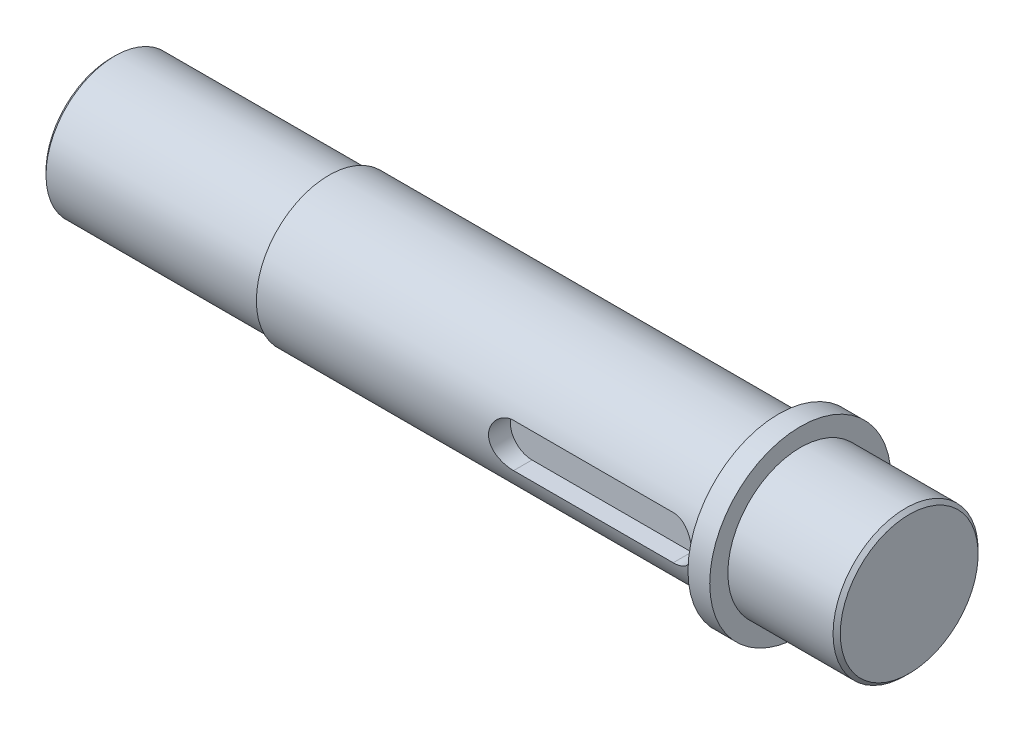
ISO-10303-21;
HEADER;
FILE_DESCRIPTION(('STEP AP214'),'2;1');
FILE_NAME('part.step','',(''),(''),'','','');
FILE_SCHEMA(('AUTOMOTIVE_DESIGN { 1 0 10303 214 1 1 1 1 }'));
ENDSEC;
DATA;
#1=APPLICATION_CONTEXT('core data for automotive mechanical design processes');
#2=APPLICATION_PROTOCOL_DEFINITION('international standard','automotive_design',2000,#1);
#3=PRODUCT_CONTEXT('',#1,'mechanical');
#4=PRODUCT('Part','Part','',(#3));
#5=PRODUCT_RELATED_PRODUCT_CATEGORY('part','',(#4));
#6=PRODUCT_DEFINITION_FORMATION('','',#4);
#7=PRODUCT_DEFINITION_CONTEXT('part definition',#1,'design');
#8=PRODUCT_DEFINITION('design','',#6,#7);
#9=PRODUCT_DEFINITION_SHAPE('','',#8);
#10=(LENGTH_UNIT() NAMED_UNIT(*) SI_UNIT(.MILLI.,.METRE.));
#11=(NAMED_UNIT(*) PLANE_ANGLE_UNIT() SI_UNIT($,.RADIAN.));
#12=(NAMED_UNIT(*) SI_UNIT($,.STERADIAN.) SOLID_ANGLE_UNIT());
#13=UNCERTAINTY_MEASURE_WITH_UNIT(LENGTH_MEASURE(1.E-05),#10,'distance_accuracy_value','');
#14=(GEOMETRIC_REPRESENTATION_CONTEXT(3) GLOBAL_UNCERTAINTY_ASSIGNED_CONTEXT((#13)) GLOBAL_UNIT_ASSIGNED_CONTEXT((#10,
#11,#12)) REPRESENTATION_CONTEXT('',''));
#15=CARTESIAN_POINT('',(0.,0.,0.));
#16=DIRECTION('',(0.,0.,1.));
#17=DIRECTION('',(1.,0.,0.));
#18=AXIS2_PLACEMENT_3D('',#15,#16,#17);
#19=CARTESIAN_POINT('',(0.,0.,0.));
#20=DIRECTION('',(1.,0.,0.));
#21=DIRECTION('',(0.,0.,-1.));
#22=AXIS2_PLACEMENT_3D('',#19,#20,#21);
#23=PLANE('',#22);
#24=CARTESIAN_POINT('',(0.,0.,0.));
#25=DIRECTION('',(1.,0.,0.));
#26=DIRECTION('',(0.,0.,-1.));
#27=AXIS2_PLACEMENT_3D('',#24,#25,#26);
#28=CIRCLE('',#27,8.99999999999999);
#29=CARTESIAN_POINT('',(0.,0.,-8.99999999999999));
#30=VERTEX_POINT('',#29);
#31=EDGE_CURVE('E208',#30,#30,#28,.F.);
#32=ORIENTED_EDGE('',*,*,#31,.T.);
#33=EDGE_LOOP('',(#32));
#34=FACE_BOUND('',#33,.T.);
#35=ADVANCED_FACE('F36',(#34),#23,.F.);
#36=CARTESIAN_POINT('',(-40.4651162790698,0.,0.));
#37=DIRECTION('',(-1.,0.,0.));
#38=DIRECTION('',(0.,0.,1.));
#39=AXIS2_PLACEMENT_3D('',#36,#37,#38);
#40=CYLINDRICAL_SURFACE('',#39,9.49999999999999);
#41=CARTESIAN_POINT('',(0.499999999999987,0.,0.));
#42=DIRECTION('',(1.,0.,0.));
#43=DIRECTION('',(0.,0.,-1.));
#44=AXIS2_PLACEMENT_3D('',#41,#42,#43);
#45=CIRCLE('',#44,9.49999999999999);
#46=CARTESIAN_POINT('',(0.499999999999987,0.,-9.49999999999999));
#47=VERTEX_POINT('',#46);
#48=EDGE_CURVE('E206',#47,#47,#45,.T.);
#49=ORIENTED_EDGE('',*,*,#48,.T.);
#50=EDGE_LOOP('',(#49));
#51=FACE_BOUND('',#50,.T.);
#52=CARTESIAN_POINT('',(30.,0.,0.));
#53=DIRECTION('',(-1.,0.,0.));
#54=DIRECTION('',(0.,0.,1.));
#55=AXIS2_PLACEMENT_3D('',#52,#53,#54);
#56=CIRCLE('',#55,9.49999999999999);
#57=CARTESIAN_POINT('',(30.,0.,9.49999999999999));
#58=VERTEX_POINT('',#57);
#59=EDGE_CURVE('E123',#58,#58,#56,.T.);
#60=ORIENTED_EDGE('',*,*,#59,.T.);
#61=EDGE_LOOP('',(#60));
#62=FACE_BOUND('',#61,.T.);
#63=ADVANCED_FACE('F183',(#51,#62),#40,.T.);
#64=CARTESIAN_POINT('',(30.,9.49999999999999,0.));
#65=DIRECTION('',(1.,0.,0.));
#66=DIRECTION('',(0.,0.,-1.));
#67=AXIS2_PLACEMENT_3D('',#64,#65,#66);
#68=PLANE('',#67);
#69=ORIENTED_EDGE('',*,*,#59,.F.);
#70=EDGE_LOOP('',(#69));
#71=FACE_BOUND('',#70,.T.);
#72=CARTESIAN_POINT('',(30.,0.,0.));
#73=DIRECTION('',(-1.,0.,0.));
#74=DIRECTION('',(0.,0.,1.));
#75=AXIS2_PLACEMENT_3D('',#72,#73,#74);
#76=CIRCLE('',#75,9.99999999999999);
#77=CARTESIAN_POINT('',(30.,0.,9.99999999999999));
#78=VERTEX_POINT('',#77);
#79=EDGE_CURVE('E120',#78,#78,#76,.T.);
#80=ORIENTED_EDGE('',*,*,#79,.T.);
#81=EDGE_LOOP('',(#80));
#82=FACE_BOUND('',#81,.T.);
#83=ADVANCED_FACE('F178',(#71,#82),#68,.F.);
#84=CARTESIAN_POINT('',(-40.4651162790698,0.,0.));
#85=DIRECTION('',(-1.,0.,0.));
#86=DIRECTION('',(0.,0.,1.));
#87=AXIS2_PLACEMENT_3D('',#84,#85,#86);
#88=CYLINDRICAL_SURFACE('',#87,9.99999999999999);
#89=DIRECTION('',(-1.,0.,0.));
#90=VECTOR('',#89,1.);
#91=CARTESIAN_POINT('',(-40.4651162790698,3.,9.53939201416944));
#92=LINE('',#91,#90);
#93=CARTESIAN_POINT('',(65.,3.,9.53939201416944));
#94=VERTEX_POINT('',#93);
#95=CARTESIAN_POINT('',(87.,3.,9.53939201416944));
#96=VERTEX_POINT('',#95);
#97=EDGE_CURVE('E60',#94,#96,#92,.F.);
#98=ORIENTED_EDGE('',*,*,#97,.T.);
#99=CARTESIAN_POINT('',(87.,3.,9.53939201416944));
#100=CARTESIAN_POINT('',(87.0823355208227,3.00001027845728,9.53938054248206));
#101=CARTESIAN_POINT('',(87.1646644550632,2.99661062684472,9.54045772064377));
#102=CARTESIAN_POINT('',(87.3286939527655,2.98307142899347,9.54470412105985));
#103=CARTESIAN_POINT('',(87.4103946533244,2.97293339805418,9.54787287296847));
#104=CARTESIAN_POINT('',(87.5723849156732,2.94603140625045,9.55620668351002));
#105=CARTESIAN_POINT('',(87.652677524043,2.92928426957737,9.56136667250113));
#106=CARTESIAN_POINT('',(87.8114758441342,2.88932853030395,9.57351626651177));
#107=CARTESIAN_POINT('',(87.8899815090674,2.8661197587264,9.58050591937826));
#108=CARTESIAN_POINT('',(88.1219493879901,2.78708584446024,9.60391637654135));
#109=CARTESIAN_POINT('',(88.272068438833,2.72181852542972,9.62279007830389));
#110=CARTESIAN_POINT('',(88.559226043979,2.56815043531276,9.66493213967818));
#111=CARTESIAN_POINT('',(88.6962584707622,2.4797388992416,9.6882025429064));
#112=CARTESIAN_POINT('',(88.9577229879478,2.27929879634443,9.73733650515373));
#113=CARTESIAN_POINT('',(89.0816848740609,2.16666914746584,9.76325505469872));
#114=CARTESIAN_POINT('',(89.3092736148388,1.92227736150433,9.81429628475076));
#115=CARTESIAN_POINT('',(89.412897033861,1.79051199848164,9.83941883019408));
#116=CARTESIAN_POINT('',(89.5989268650945,1.50821997465697,9.88666477976533));
#117=CARTESIAN_POINT('',(89.6808501797826,1.35736167401015,9.90871541546876));
#118=CARTESIAN_POINT('',(89.8179770040029,1.04324233568302,9.94668940088143));
#119=CARTESIAN_POINT('',(89.873187403368,0.879984508687984,9.96261433032401));
#120=CARTESIAN_POINT('',(89.953759551791,0.550649404820601,9.98615279768396));
#121=CARTESIAN_POINT('',(89.9799297035176,0.384786253016201,9.99399098526791));
#122=CARTESIAN_POINT('',(90.004234695146,0.050847141568925,10.0012640407204));
#123=CARTESIAN_POINT('',(90.0023748426782,-0.117228393125342,10.0007004995012));
#124=CARTESIAN_POINT('',(89.9712141793085,-0.445143199271828,9.99139205125585));
#125=CARTESIAN_POINT('',(89.9427893091919,-0.605074290763032,9.98290831016511));
#126=CARTESIAN_POINT('',(89.8607367303745,-0.917780104370316,9.95903027401821));
#127=CARTESIAN_POINT('',(89.8071077013173,-1.07055445110879,9.94363561692557));
#128=CARTESIAN_POINT('',(89.6755755564753,-1.36669563173911,9.90730429851781));
#129=CARTESIAN_POINT('',(89.5973967112239,-1.50993201207612,9.88630511384913));
#130=CARTESIAN_POINT('',(89.4192028199656,-1.781531059161,9.84099249303646));
#131=CARTESIAN_POINT('',(89.3191828810593,-1.9098903832325,9.81667831471804));
#132=CARTESIAN_POINT('',(89.0956160238154,-2.15330901082205,9.76623347142779));
#133=CARTESIAN_POINT('',(88.9713122724738,-2.26766702955975,9.74006890899096));
#134=CARTESIAN_POINT('',(88.7050051531489,-2.47413538985067,9.68968430229326));
#135=CARTESIAN_POINT('',(88.5629966392702,-2.5662392402618,9.66546482675132));
#136=CARTESIAN_POINT('',(88.2634381431001,-2.72632814481701,9.62154457591302));
#137=CARTESIAN_POINT('',(88.1057456408129,-2.79406012682263,9.60189192491894));
#138=CARTESIAN_POINT('',(87.7805509920369,-2.90171772009405,9.56991327306401));
#139=CARTESIAN_POINT('',(87.6130642785713,-2.94168586436072,9.55757606951748));
#140=CARTESIAN_POINT('',(87.3700102218596,-2.97802407180159,9.5462806465001));
#141=CARTESIAN_POINT('',(87.2962185316408,-2.98626405978017,9.54370312550532));
#142=CARTESIAN_POINT('',(87.1482970418009,-2.99724711229708,9.54025857223563));
#143=CARTESIAN_POINT('',(87.0741679006723,-2.99999825936538,9.53938902493286));
#144=CARTESIAN_POINT('',(87.,-3.,9.53939201416944));
#145=B_SPLINE_CURVE_WITH_KNOTS('',3,(#99,#100,#101,#102,#103,#104,#105,#106,#107,#108,#109,#110,
#111,#112,#113,#114,#115,#116,#117,#118,#119,#120,#121,#122,#123,#124,#125,#126,#127,#128,#129,
#130,#131,#132,#133,#134,#135,#136,#137,#138,#139,#140,#141,#142,#143,#144),.UNSPECIFIED.,.F.,
.F.,(4,2,2,2,2,2,2,2,2,2,2,2,2,2,2,2,2,2,2,2,2,2,4),(0.,0.246918142439474,0.493780777706094,
0.740019009623012,0.986263681482027,1.47813347402025,1.97023245590778,2.47635119822767,
2.98255536239033,3.49922810620071,4.01576751791672,4.51753600864764,5.01920948804101,
5.50490358251093,5.99062312360832,6.48200583350621,6.9734987373917,7.48389234847122,
7.99443465298715,8.51013494368214,9.02504345105574,9.24774267716777,9.47011372732391),.UNSPECIFIED.);
#146=CARTESIAN_POINT('',(87.,-3.,9.53939201416944));
#147=VERTEX_POINT('',#146);
#148=EDGE_CURVE('E126',#96,#147,#145,.T.);
#149=ORIENTED_EDGE('',*,*,#148,.T.);
#150=DIRECTION('',(-1.,0.,0.));
#151=VECTOR('',#150,1.);
#152=CARTESIAN_POINT('',(-40.4651162790698,-3.,9.53939201416944));
#153=LINE('',#152,#151);
#154=CARTESIAN_POINT('',(65.,-3.,9.53939201416944));
#155=VERTEX_POINT('',#154);
#156=EDGE_CURVE('E211',#147,#155,#153,.T.);
#157=ORIENTED_EDGE('',*,*,#156,.T.);
#158=CARTESIAN_POINT('',(65.,-3.,9.53939201416944));
#159=CARTESIAN_POINT('',(64.9176644791773,-3.00001027845728,9.53938054248206));
#160=CARTESIAN_POINT('',(64.8353355449368,-2.99661062684472,9.54045772064377));
#161=CARTESIAN_POINT('',(64.6713060472345,-2.98307142899347,9.54470412105985));
#162=CARTESIAN_POINT('',(64.5896053466756,-2.97293339805418,9.54787287296847));
#163=CARTESIAN_POINT('',(64.4276150843268,-2.94603140625045,9.55620668351002));
#164=CARTESIAN_POINT('',(64.347322475957,-2.92928426957737,9.56136667250113));
#165=CARTESIAN_POINT('',(64.1885241558658,-2.88932853030395,9.57351626651177));
#166=CARTESIAN_POINT('',(64.1100184909326,-2.8661197587264,9.58050591937826));
#167=CARTESIAN_POINT('',(63.8780506120099,-2.78708584446024,9.60391637654135));
#168=CARTESIAN_POINT('',(63.727931561167,-2.72181852542972,9.62279007830389));
#169=CARTESIAN_POINT('',(63.440773956021,-2.56815043531276,9.66493213967818));
#170=CARTESIAN_POINT('',(63.3037415292378,-2.4797388992416,9.6882025429064));
#171=CARTESIAN_POINT('',(63.0422770120522,-2.27929879634443,9.73733650515373));
#172=CARTESIAN_POINT('',(62.9183151259391,-2.16666914746584,9.76325505469872));
#173=CARTESIAN_POINT('',(62.6907263851612,-1.92227736150433,9.81429628475076));
#174=CARTESIAN_POINT('',(62.587102966139,-1.79051199848164,9.83941883019408));
#175=CARTESIAN_POINT('',(62.4010731349054,-1.50821997465697,9.88666477976533));
#176=CARTESIAN_POINT('',(62.3191498202174,-1.35736167401016,9.90871541546876));
#177=CARTESIAN_POINT('',(62.1820229959971,-1.04324233568303,9.94668940088143));
#178=CARTESIAN_POINT('',(62.126812596632,-0.879984508687983,9.96261433032402));
#179=CARTESIAN_POINT('',(62.046240448209,-0.550649404820598,9.98615279768397));
#180=CARTESIAN_POINT('',(62.0200702964824,-0.384786253016201,9.99399098526791));
#181=CARTESIAN_POINT('',(61.995765304854,-0.0508471415689267,10.0012640407204));
#182=CARTESIAN_POINT('',(61.9976251573218,0.117228393125339,10.0007004995012));
#183=CARTESIAN_POINT('',(62.0287858206914,0.445143199271825,9.99139205125585));
#184=CARTESIAN_POINT('',(62.0572106908081,0.605074290763029,9.98290831016511));
#185=CARTESIAN_POINT('',(62.1392632696255,0.917780104370315,9.95903027401821));
#186=CARTESIAN_POINT('',(62.1928922986827,1.07055445110879,9.94363561692557));
#187=CARTESIAN_POINT('',(62.3244244435248,1.36669563173912,9.90730429851781));
#188=CARTESIAN_POINT('',(62.4026032887761,1.50993201207612,9.88630511384913));
#189=CARTESIAN_POINT('',(62.5807971800344,1.781531059161,9.84099249303645));
#190=CARTESIAN_POINT('',(62.6808171189407,1.9098903832325,9.81667831471804));
#191=CARTESIAN_POINT('',(62.9043839761846,2.15330901082205,9.76623347142779));
#192=CARTESIAN_POINT('',(63.0286877275262,2.26766702955975,9.74006890899096));
#193=CARTESIAN_POINT('',(63.2949948468511,2.47413538985067,9.68968430229326));
#194=CARTESIAN_POINT('',(63.4370033607298,2.5662392402618,9.66546482675132));
#195=CARTESIAN_POINT('',(63.7365618568999,2.72632814481701,9.62154457591302));
#196=CARTESIAN_POINT('',(63.8942543591871,2.79406012682262,9.60189192491894));
#197=CARTESIAN_POINT('',(64.2194490079631,2.90171772009404,9.56991327306401));
#198=CARTESIAN_POINT('',(64.3869357214287,2.94168586436072,9.55757606951748));
#199=CARTESIAN_POINT('',(64.6299897781404,2.97802407180159,9.5462806465001));
#200=CARTESIAN_POINT('',(64.7037814683592,2.98626405978017,9.54370312550532));
#201=CARTESIAN_POINT('',(64.851702958199,2.99724711229708,9.54025857223563));
#202=CARTESIAN_POINT('',(64.9258320993277,2.99999825936538,9.53938902493286));
#203=CARTESIAN_POINT('',(65.,3.,9.53939201416944));
#204=B_SPLINE_CURVE_WITH_KNOTS('',3,(#158,#159,#160,#161,#162,#163,#164,#165,#166,#167,#168,
#169,#170,#171,#172,#173,#174,#175,#176,#177,#178,#179,#180,#181,#182,#183,#184,#185,#186,#187,
#188,#189,#190,#191,#192,#193,#194,#195,#196,#197,#198,#199,#200,#201,#202,#203),.UNSPECIFIED.,
.F.,.F.,(4,2,2,2,2,2,2,2,2,2,2,2,2,2,2,2,2,2,2,2,2,2,4),(0.,0.246918142439488,0.493780777706094,
0.740019009623012,0.986263681482027,1.47813347402025,1.97023245590778,2.47635119822767,
2.98255536239033,3.49922810620071,4.01576751791672,4.51753600864764,5.01920948804101,
5.50490358251093,5.99062312360831,6.48200583350621,6.9734987373917,7.48389234847122,
7.99443465298715,8.51013494368214,9.02504345105574,9.24774267716777,9.47011372732391),.UNSPECIFIED.);
#205=EDGE_CURVE('E52',#155,#94,#204,.T.);
#206=ORIENTED_EDGE('',*,*,#205,.T.);
#207=EDGE_LOOP('',(#98,#149,#157,#206));
#208=FACE_BOUND('',#207,.T.);
#209=ORIENTED_EDGE('',*,*,#79,.F.);
#210=EDGE_LOOP('',(#209));
#211=FACE_BOUND('',#210,.T.);
#212=CARTESIAN_POINT('',(92.,0.,0.));
#213=DIRECTION('',(-1.,0.,0.));
#214=DIRECTION('',(0.,0.,1.));
#215=AXIS2_PLACEMENT_3D('',#212,#213,#214);
#216=CIRCLE('',#215,9.99999999999999);
#217=CARTESIAN_POINT('',(92.,0.,9.99999999999999));
#218=VERTEX_POINT('',#217);
#219=EDGE_CURVE('E117',#218,#218,#216,.T.);
#220=ORIENTED_EDGE('',*,*,#219,.T.);
#221=EDGE_LOOP('',(#220));
#222=FACE_BOUND('',#221,.T.);
#223=ADVANCED_FACE('F141',(#208,#211,#222),#88,.T.);
#224=CARTESIAN_POINT('',(92.,9.99999999999999,0.));
#225=DIRECTION('',(1.,0.,0.));
#226=DIRECTION('',(0.,0.,-1.));
#227=AXIS2_PLACEMENT_3D('',#224,#225,#226);
#228=PLANE('',#227);
#229=ORIENTED_EDGE('',*,*,#219,.F.);
#230=EDGE_LOOP('',(#229));
#231=FACE_BOUND('',#230,.T.);
#232=CARTESIAN_POINT('',(92.,0.,0.));
#233=DIRECTION('',(-1.,0.,0.));
#234=DIRECTION('',(0.,0.,1.));
#235=AXIS2_PLACEMENT_3D('',#232,#233,#234);
#236=CIRCLE('',#235,12.5);
#237=CARTESIAN_POINT('',(92.,0.,12.5));
#238=VERTEX_POINT('',#237);
#239=EDGE_CURVE('E114',#238,#238,#236,.T.);
#240=ORIENTED_EDGE('',*,*,#239,.T.);
#241=EDGE_LOOP('',(#240));
#242=FACE_BOUND('',#241,.T.);
#243=ADVANCED_FACE('F171',(#231,#242),#228,.F.);
#244=CARTESIAN_POINT('',(-40.4651162790698,0.,0.));
#245=DIRECTION('',(-1.,0.,0.));
#246=DIRECTION('',(0.,0.,1.));
#247=AXIS2_PLACEMENT_3D('',#244,#245,#246);
#248=CYLINDRICAL_SURFACE('',#247,12.5);
#249=ORIENTED_EDGE('',*,*,#239,.F.);
#250=EDGE_LOOP('',(#249));
#251=FACE_BOUND('',#250,.T.);
#252=CARTESIAN_POINT('',(95.,0.,0.));
#253=DIRECTION('',(-1.,0.,0.));
#254=DIRECTION('',(0.,0.,1.));
#255=AXIS2_PLACEMENT_3D('',#252,#253,#254);
#256=CIRCLE('',#255,12.5);
#257=CARTESIAN_POINT('',(95.,0.,12.5));
#258=VERTEX_POINT('',#257);
#259=EDGE_CURVE('E111',#258,#258,#256,.T.);
#260=ORIENTED_EDGE('',*,*,#259,.T.);
#261=EDGE_LOOP('',(#260));
#262=FACE_BOUND('',#261,.T.);
#263=ADVANCED_FACE('F168',(#251,#262),#248,.T.);
#264=CARTESIAN_POINT('',(95.,12.5,0.));
#265=DIRECTION('',(-1.,0.,0.));
#266=DIRECTION('',(0.,0.,1.));
#267=AXIS2_PLACEMENT_3D('',#264,#265,#266);
#268=PLANE('',#267);
#269=ORIENTED_EDGE('',*,*,#259,.F.);
#270=EDGE_LOOP('',(#269));
#271=FACE_BOUND('',#270,.T.);
#272=CARTESIAN_POINT('',(95.,0.,0.));
#273=DIRECTION('',(-1.,0.,0.));
#274=DIRECTION('',(0.,0.,1.));
#275=AXIS2_PLACEMENT_3D('',#272,#273,#274);
#276=CIRCLE('',#275,9.99999999999999);
#277=CARTESIAN_POINT('',(95.,0.,9.99999999999999));
#278=VERTEX_POINT('',#277);
#279=EDGE_CURVE('E105',#278,#278,#276,.T.);
#280=ORIENTED_EDGE('',*,*,#279,.T.);
#281=EDGE_LOOP('',(#280));
#282=FACE_BOUND('',#281,.T.);
#283=ADVANCED_FACE('F164',(#271,#282),#268,.F.);
#284=CARTESIAN_POINT('',(-40.4651162790698,0.,0.));
#285=DIRECTION('',(-1.,0.,0.));
#286=DIRECTION('',(0.,0.,1.));
#287=AXIS2_PLACEMENT_3D('',#284,#285,#286);
#288=CYLINDRICAL_SURFACE('',#287,9.99999999999999);
#289=CARTESIAN_POINT('',(109.5,0.,0.));
#290=DIRECTION('',(-1.,0.,0.));
#291=DIRECTION('',(0.,0.,1.));
#292=AXIS2_PLACEMENT_3D('',#289,#290,#291);
#293=CIRCLE('',#292,9.99999999999999);
#294=CARTESIAN_POINT('',(109.5,0.,9.99999999999999));
#295=VERTEX_POINT('',#294);
#296=EDGE_CURVE('E45',#295,#295,#293,.T.);
#297=ORIENTED_EDGE('',*,*,#296,.T.);
#298=EDGE_LOOP('',(#297));
#299=FACE_BOUND('',#298,.T.);
#300=ORIENTED_EDGE('',*,*,#279,.F.);
#301=EDGE_LOOP('',(#300));
#302=FACE_BOUND('',#301,.T.);
#303=ADVANCED_FACE('F160',(#299,#302),#288,.T.);
#304=CARTESIAN_POINT('',(110.,9.99999999999999,0.));
#305=DIRECTION('',(-1.,0.,0.));
#306=DIRECTION('',(0.,0.,1.));
#307=AXIS2_PLACEMENT_3D('',#304,#305,#306);
#308=PLANE('',#307);
#309=CARTESIAN_POINT('',(110.,0.,0.));
#310=DIRECTION('',(-1.,0.,0.));
#311=DIRECTION('',(0.,0.,1.));
#312=AXIS2_PLACEMENT_3D('',#309,#310,#311);
#313=CIRCLE('',#312,9.49999999999995);
#314=CARTESIAN_POINT('',(110.,0.,9.49999999999995));
#315=VERTEX_POINT('',#314);
#316=EDGE_CURVE('E11',#315,#315,#313,.F.);
#317=ORIENTED_EDGE('',*,*,#316,.T.);
#318=EDGE_LOOP('',(#317));
#319=FACE_BOUND('',#318,.T.);
#320=ADVANCED_FACE('F157',(#319),#308,.F.);
#321=CARTESIAN_POINT('',(65.,0.,6.99999999999999));
#322=DIRECTION('',(0.,0.,1.));
#323=DIRECTION('',(1.,0.,0.));
#324=AXIS2_PLACEMENT_3D('',#321,#322,#323);
#325=CYLINDRICAL_SURFACE('',#324,3.);
#326=DIRECTION('',(0.,0.,1.));
#327=VECTOR('',#326,1.);
#328=CARTESIAN_POINT('',(65.,-3.,6.99999999999999));
#329=LINE('',#328,#327);
#330=CARTESIAN_POINT('',(65.,-3.,6.99999999999999));
#331=VERTEX_POINT('',#330);
#332=EDGE_CURVE('E77',#331,#155,#329,.T.);
#333=ORIENTED_EDGE('',*,*,#332,.F.);
#334=CARTESIAN_POINT('',(65.,0.,6.99999999999999));
#335=DIRECTION('',(0.,0.,1.));
#336=DIRECTION('',(1.,0.,0.));
#337=AXIS2_PLACEMENT_3D('',#334,#335,#336);
#338=CIRCLE('',#337,3.);
#339=CARTESIAN_POINT('',(65.,3.,6.99999999999999));
#340=VERTEX_POINT('',#339);
#341=EDGE_CURVE('E81',#340,#331,#338,.T.);
#342=ORIENTED_EDGE('',*,*,#341,.F.);
#343=DIRECTION('',(0.,0.,1.));
#344=VECTOR('',#343,1.);
#345=CARTESIAN_POINT('',(65.,3.,6.99999999999999));
#346=LINE('',#345,#344);
#347=EDGE_CURVE('E103',#340,#94,#346,.T.);
#348=ORIENTED_EDGE('',*,*,#347,.T.);
#349=ORIENTED_EDGE('',*,*,#205,.F.);
#350=EDGE_LOOP('',(#333,#342,#348,#349));
#351=FACE_BOUND('',#350,.T.);
#352=ADVANCED_FACE('F79',(#351),#325,.F.);
#353=CARTESIAN_POINT('',(65.,3.,6.99999999999999));
#354=DIRECTION('',(0.,1.,0.));
#355=DIRECTION('',(0.,0.,1.));
#356=AXIS2_PLACEMENT_3D('',#353,#354,#355);
#357=PLANE('',#356);
#358=ORIENTED_EDGE('',*,*,#347,.F.);
#359=DIRECTION('',(-1.,0.,0.));
#360=VECTOR('',#359,1.);
#361=CARTESIAN_POINT('',(65.,3.,6.99999999999999));
#362=LINE('',#361,#360);
#363=CARTESIAN_POINT('',(87.,3.,6.99999999999999));
#364=VERTEX_POINT('',#363);
#365=EDGE_CURVE('E86',#364,#340,#362,.T.);
#366=ORIENTED_EDGE('',*,*,#365,.F.);
#367=DIRECTION('',(0.,0.,1.));
#368=VECTOR('',#367,1.);
#369=CARTESIAN_POINT('',(87.,3.,6.99999999999999));
#370=LINE('',#369,#368);
#371=EDGE_CURVE('E106',#364,#96,#370,.T.);
#372=ORIENTED_EDGE('',*,*,#371,.T.);
#373=ORIENTED_EDGE('',*,*,#97,.F.);
#374=EDGE_LOOP('',(#358,#366,#372,#373));
#375=FACE_BOUND('',#374,.T.);
#376=ADVANCED_FACE('F150',(#375),#357,.F.);
#377=CARTESIAN_POINT('',(87.,0.,6.99999999999999));
#378=DIRECTION('',(0.,0.,1.));
#379=DIRECTION('',(1.,0.,0.));
#380=AXIS2_PLACEMENT_3D('',#377,#378,#379);
#381=CYLINDRICAL_SURFACE('',#380,3.);
#382=ORIENTED_EDGE('',*,*,#371,.F.);
#383=CARTESIAN_POINT('',(87.,0.,6.99999999999999));
#384=DIRECTION('',(0.,0.,1.));
#385=DIRECTION('',(1.,0.,0.));
#386=AXIS2_PLACEMENT_3D('',#383,#384,#385);
#387=CIRCLE('',#386,3.);
#388=CARTESIAN_POINT('',(87.,-3.,6.99999999999999));
#389=VERTEX_POINT('',#388);
#390=EDGE_CURVE('E95',#389,#364,#387,.T.);
#391=ORIENTED_EDGE('',*,*,#390,.F.);
#392=DIRECTION('',(0.,0.,1.));
#393=VECTOR('',#392,1.);
#394=CARTESIAN_POINT('',(87.,-3.,6.99999999999999));
#395=LINE('',#394,#393);
#396=EDGE_CURVE('E85',#389,#147,#395,.T.);
#397=ORIENTED_EDGE('',*,*,#396,.T.);
#398=ORIENTED_EDGE('',*,*,#148,.F.);
#399=EDGE_LOOP('',(#382,#391,#397,#398));
#400=FACE_BOUND('',#399,.T.);
#401=ADVANCED_FACE('F145',(#400),#381,.F.);
#402=CARTESIAN_POINT('',(65.,-3.,6.99999999999999));
#403=DIRECTION('',(0.,-1.,0.));
#404=DIRECTION('',(0.,0.,-1.));
#405=AXIS2_PLACEMENT_3D('',#402,#403,#404);
#406=PLANE('',#405);
#407=ORIENTED_EDGE('',*,*,#396,.F.);
#408=DIRECTION('',(1.,0.,0.));
#409=VECTOR('',#408,1.);
#410=CARTESIAN_POINT('',(65.,-3.,6.99999999999999));
#411=LINE('',#410,#409);
#412=EDGE_CURVE('E89',#331,#389,#411,.T.);
#413=ORIENTED_EDGE('',*,*,#412,.F.);
#414=ORIENTED_EDGE('',*,*,#332,.T.);
#415=ORIENTED_EDGE('',*,*,#156,.F.);
#416=EDGE_LOOP('',(#407,#413,#414,#415));
#417=FACE_BOUND('',#416,.T.);
#418=ADVANCED_FACE('F90',(#417),#406,.F.);
#419=CARTESIAN_POINT('',(65.,0.,6.99999999999999));
#420=DIRECTION('',(0.,0.,1.));
#421=DIRECTION('',(1.,0.,0.));
#422=AXIS2_PLACEMENT_3D('',#419,#420,#421);
#423=PLANE('',#422);
#424=ORIENTED_EDGE('',*,*,#341,.T.);
#425=ORIENTED_EDGE('',*,*,#412,.T.);
#426=ORIENTED_EDGE('',*,*,#390,.T.);
#427=ORIENTED_EDGE('',*,*,#365,.T.);
#428=EDGE_LOOP('',(#424,#425,#426,#427));
#429=FACE_BOUND('',#428,.T.);
#430=ADVANCED_FACE('F97',(#429),#423,.T.);
#431=CARTESIAN_POINT('',(0.,0.,0.));
#432=DIRECTION('',(1.,0.,0.));
#433=DIRECTION('',(0.,0.,-1.));
#434=AXIS2_PLACEMENT_3D('',#431,#432,#433);
#435=CONICAL_SURFACE('',#434,8.99999999999999,0.785398163397454);
#436=ORIENTED_EDGE('',*,*,#48,.F.);
#437=EDGE_LOOP('',(#436));
#438=FACE_BOUND('',#437,.T.);
#439=ORIENTED_EDGE('',*,*,#31,.F.);
#440=EDGE_LOOP('',(#439));
#441=FACE_BOUND('',#440,.T.);
#442=ADVANCED_FACE('F193',(#438,#441),#435,.T.);
#443=CARTESIAN_POINT('',(109.5,0.,0.));
#444=DIRECTION('',(-1.,0.,0.));
#445=DIRECTION('',(0.,0.,1.));
#446=AXIS2_PLACEMENT_3D('',#443,#444,#445);
#447=CONICAL_SURFACE('',#446,9.99999999999999,0.785398163397473);
#448=ORIENTED_EDGE('',*,*,#316,.F.);
#449=EDGE_LOOP('',(#448));
#450=FACE_BOUND('',#449,.T.);
#451=ORIENTED_EDGE('',*,*,#296,.F.);
#452=EDGE_LOOP('',(#451));
#453=FACE_BOUND('',#452,.T.);
#454=ADVANCED_FACE('F39',(#450,#453),#447,.T.);
#455=CLOSED_SHELL('',(#35,#63,#83,#223,#243,#263,#283,#303,#320,#352,#376,#401,#418,#430,#442,#454));
#456=MANIFOLD_SOLID_BREP('B2',#455);
#457=ADVANCED_BREP_SHAPE_REPRESENTATION('',(#18,#456),#14);
#458=SHAPE_DEFINITION_REPRESENTATION(#9,#457);
ENDSEC;
END-ISO-10303-21;
